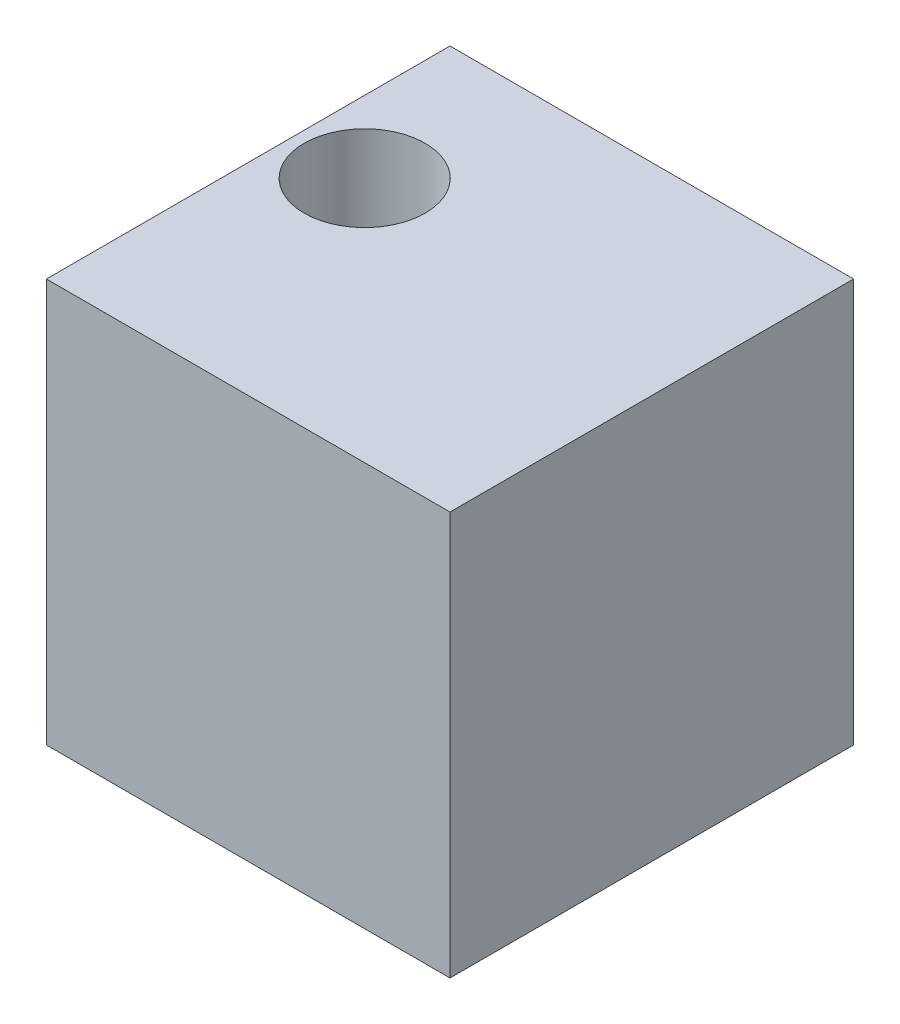
ISO-10303-21;
HEADER;
FILE_DESCRIPTION(('STEP AP214'),'2;1');
FILE_NAME('part.step','',(''),(''),'','','');
FILE_SCHEMA(('AUTOMOTIVE_DESIGN { 1 0 10303 214 1 1 1 1 }'));
ENDSEC;
DATA;
#1=APPLICATION_CONTEXT('core data for automotive mechanical design processes');
#2=APPLICATION_PROTOCOL_DEFINITION('international standard','automotive_design',2000,#1);
#3=PRODUCT_CONTEXT('',#1,'mechanical');
#4=PRODUCT('Part','Part','',(#3));
#5=PRODUCT_RELATED_PRODUCT_CATEGORY('part','',(#4));
#6=PRODUCT_DEFINITION_FORMATION('','',#4);
#7=PRODUCT_DEFINITION_CONTEXT('part definition',#1,'design');
#8=PRODUCT_DEFINITION('design','',#6,#7);
#9=PRODUCT_DEFINITION_SHAPE('','',#8);
#10=(LENGTH_UNIT() NAMED_UNIT(*) SI_UNIT(.MILLI.,.METRE.));
#11=(NAMED_UNIT(*) PLANE_ANGLE_UNIT() SI_UNIT($,.RADIAN.));
#12=(NAMED_UNIT(*) SI_UNIT($,.STERADIAN.) SOLID_ANGLE_UNIT());
#13=UNCERTAINTY_MEASURE_WITH_UNIT(LENGTH_MEASURE(1.E-05),#10,'distance_accuracy_value','');
#14=(GEOMETRIC_REPRESENTATION_CONTEXT(3) GLOBAL_UNCERTAINTY_ASSIGNED_CONTEXT((#13)) GLOBAL_UNIT_ASSIGNED_CONTEXT((#10,
#11,#12)) REPRESENTATION_CONTEXT('',''));
#15=CARTESIAN_POINT('',(0.,0.,0.));
#16=DIRECTION('',(0.,0.,1.));
#17=DIRECTION('',(1.,0.,0.));
#18=AXIS2_PLACEMENT_3D('',#15,#16,#17);
#19=CARTESIAN_POINT('',(0.,0.,25.4));
#20=DIRECTION('',(1.,0.,0.));
#21=DIRECTION('',(0.,0.,-1.));
#22=AXIS2_PLACEMENT_3D('',#19,#20,#21);
#23=PLANE('',#22);
#24=DIRECTION('',(0.,-1.,0.));
#25=VECTOR('',#24,1.);
#26=CARTESIAN_POINT('',(0.,0.,0.));
#27=LINE('',#26,#25);
#28=CARTESIAN_POINT('',(0.,25.4,0.));
#29=VERTEX_POINT('',#28);
#30=CARTESIAN_POINT('',(0.,0.,0.));
#31=VERTEX_POINT('',#30);
#32=EDGE_CURVE('E107',#29,#31,#27,.T.);
#33=ORIENTED_EDGE('',*,*,#32,.T.);
#34=DIRECTION('',(0.,0.,-1.));
#35=VECTOR('',#34,1.);
#36=CARTESIAN_POINT('',(0.,0.,25.4));
#37=LINE('',#36,#35);
#38=CARTESIAN_POINT('',(0.,0.,25.4));
#39=VERTEX_POINT('',#38);
#40=EDGE_CURVE('E11',#39,#31,#37,.T.);
#41=ORIENTED_EDGE('',*,*,#40,.F.);
#42=DIRECTION('',(0.,-1.,0.));
#43=VECTOR('',#42,1.);
#44=CARTESIAN_POINT('',(0.,0.,25.4));
#45=LINE('',#44,#43);
#46=CARTESIAN_POINT('',(0.,25.4,25.4));
#47=VERTEX_POINT('',#46);
#48=EDGE_CURVE('E91',#47,#39,#45,.T.);
#49=ORIENTED_EDGE('',*,*,#48,.F.);
#50=DIRECTION('',(0.,0.,-1.));
#51=VECTOR('',#50,1.);
#52=CARTESIAN_POINT('',(0.,25.4,25.4));
#53=LINE('',#52,#51);
#54=EDGE_CURVE('E103',#47,#29,#53,.T.);
#55=ORIENTED_EDGE('',*,*,#54,.T.);
#56=EDGE_LOOP('',(#33,#41,#49,#55));
#57=FACE_BOUND('',#56,.T.);
#58=ADVANCED_FACE('F39',(#57),#23,.F.);
#59=CARTESIAN_POINT('',(0.,0.,25.4));
#60=DIRECTION('',(0.,1.,0.));
#61=DIRECTION('',(0.,0.,1.));
#62=AXIS2_PLACEMENT_3D('',#59,#60,#61);
#63=PLANE('',#62);
#64=CARTESIAN_POINT('',(4.52047726833796,0.,9.89111738509195));
#65=DIRECTION('',(0.,1.,0.));
#66=DIRECTION('',(0.,0.,1.));
#67=AXIS2_PLACEMENT_3D('',#64,#65,#66);
#68=CIRCLE('',#67,3.81);
#69=CARTESIAN_POINT('',(4.52047726833796,0.,13.7011173850919));
#70=VERTEX_POINT('',#69);
#71=EDGE_CURVE('E111',#70,#70,#68,.T.);
#72=ORIENTED_EDGE('',*,*,#71,.T.);
#73=EDGE_LOOP('',(#72));
#74=FACE_BOUND('',#73,.T.);
#75=DIRECTION('',(1.,0.,0.));
#76=VECTOR('',#75,1.);
#77=CARTESIAN_POINT('',(0.,0.,0.));
#78=LINE('',#77,#76);
#79=CARTESIAN_POINT('',(25.4,0.,0.));
#80=VERTEX_POINT('',#79);
#81=EDGE_CURVE('E96',#31,#80,#78,.T.);
#82=ORIENTED_EDGE('',*,*,#81,.T.);
#83=DIRECTION('',(0.,0.,-1.));
#84=VECTOR('',#83,1.);
#85=CARTESIAN_POINT('',(25.4,0.,25.4));
#86=LINE('',#85,#84);
#87=CARTESIAN_POINT('',(25.4,0.,25.4));
#88=VERTEX_POINT('',#87);
#89=EDGE_CURVE('E48',#88,#80,#86,.T.);
#90=ORIENTED_EDGE('',*,*,#89,.F.);
#91=DIRECTION('',(1.,0.,0.));
#92=VECTOR('',#91,1.);
#93=CARTESIAN_POINT('',(0.,0.,25.4));
#94=LINE('',#93,#92);
#95=EDGE_CURVE('E86',#39,#88,#94,.T.);
#96=ORIENTED_EDGE('',*,*,#95,.F.);
#97=ORIENTED_EDGE('',*,*,#40,.T.);
#98=EDGE_LOOP('',(#82,#90,#96,#97));
#99=FACE_BOUND('',#98,.T.);
#100=ADVANCED_FACE('F95',(#74,#99),#63,.F.);
#101=CARTESIAN_POINT('',(25.4,0.,25.4));
#102=DIRECTION('',(-1.,0.,0.));
#103=DIRECTION('',(0.,0.,1.));
#104=AXIS2_PLACEMENT_3D('',#101,#102,#103);
#105=PLANE('',#104);
#106=DIRECTION('',(0.,1.,0.));
#107=VECTOR('',#106,1.);
#108=CARTESIAN_POINT('',(25.4,0.,0.));
#109=LINE('',#108,#107);
#110=CARTESIAN_POINT('',(25.4,25.4,0.));
#111=VERTEX_POINT('',#110);
#112=EDGE_CURVE('E73',#80,#111,#109,.T.);
#113=ORIENTED_EDGE('',*,*,#112,.T.);
#114=DIRECTION('',(0.,0.,-1.));
#115=VECTOR('',#114,1.);
#116=CARTESIAN_POINT('',(25.4,25.4,25.4));
#117=LINE('',#116,#115);
#118=CARTESIAN_POINT('',(25.4,25.4,25.4));
#119=VERTEX_POINT('',#118);
#120=EDGE_CURVE('E98',#119,#111,#117,.T.);
#121=ORIENTED_EDGE('',*,*,#120,.F.);
#122=DIRECTION('',(0.,1.,0.));
#123=VECTOR('',#122,1.);
#124=CARTESIAN_POINT('',(25.4,0.,25.4));
#125=LINE('',#124,#123);
#126=EDGE_CURVE('E89',#88,#119,#125,.T.);
#127=ORIENTED_EDGE('',*,*,#126,.F.);
#128=ORIENTED_EDGE('',*,*,#89,.T.);
#129=EDGE_LOOP('',(#113,#121,#127,#128));
#130=FACE_BOUND('',#129,.T.);
#131=ADVANCED_FACE('F99',(#130),#105,.F.);
#132=CARTESIAN_POINT('',(0.,25.4,25.4));
#133=DIRECTION('',(0.,-1.,0.));
#134=DIRECTION('',(0.,0.,-1.));
#135=AXIS2_PLACEMENT_3D('',#132,#133,#134);
#136=PLANE('',#135);
#137=CARTESIAN_POINT('',(4.52047726833796,25.4,9.89111738509195));
#138=DIRECTION('',(0.,1.,0.));
#139=DIRECTION('',(0.,0.,1.));
#140=AXIS2_PLACEMENT_3D('',#137,#138,#139);
#141=CIRCLE('',#140,3.81);
#142=CARTESIAN_POINT('',(4.52047726833796,25.4,13.7011173850919));
#143=VERTEX_POINT('',#142);
#144=EDGE_CURVE('E128',#143,#143,#141,.T.);
#145=ORIENTED_EDGE('',*,*,#144,.F.);
#146=EDGE_LOOP('',(#145));
#147=FACE_BOUND('',#146,.T.);
#148=DIRECTION('',(-1.,0.,0.));
#149=VECTOR('',#148,1.);
#150=CARTESIAN_POINT('',(0.,25.4,0.));
#151=LINE('',#150,#149);
#152=EDGE_CURVE('E79',#111,#29,#151,.T.);
#153=ORIENTED_EDGE('',*,*,#152,.T.);
#154=ORIENTED_EDGE('',*,*,#54,.F.);
#155=DIRECTION('',(-1.,0.,0.));
#156=VECTOR('',#155,1.);
#157=CARTESIAN_POINT('',(0.,25.4,25.4));
#158=LINE('',#157,#156);
#159=EDGE_CURVE('E56',#119,#47,#158,.T.);
#160=ORIENTED_EDGE('',*,*,#159,.F.);
#161=ORIENTED_EDGE('',*,*,#120,.T.);
#162=EDGE_LOOP('',(#153,#154,#160,#161));
#163=FACE_BOUND('',#162,.T.);
#164=ADVANCED_FACE('F121',(#147,#163),#136,.F.);
#165=CARTESIAN_POINT('',(0.,0.,25.4));
#166=DIRECTION('',(0.,0.,-1.));
#167=DIRECTION('',(-1.,0.,0.));
#168=AXIS2_PLACEMENT_3D('',#165,#166,#167);
#169=PLANE('',#168);
#170=ORIENTED_EDGE('',*,*,#48,.T.);
#171=ORIENTED_EDGE('',*,*,#95,.T.);
#172=ORIENTED_EDGE('',*,*,#126,.T.);
#173=ORIENTED_EDGE('',*,*,#159,.T.);
#174=EDGE_LOOP('',(#170,#171,#172,#173));
#175=FACE_BOUND('',#174,.T.);
#176=ADVANCED_FACE('F87',(#175),#169,.F.);
#177=CARTESIAN_POINT('',(0.,0.,0.));
#178=DIRECTION('',(0.,0.,-1.));
#179=DIRECTION('',(-1.,0.,0.));
#180=AXIS2_PLACEMENT_3D('',#177,#178,#179);
#181=PLANE('',#180);
#182=ORIENTED_EDGE('',*,*,#32,.F.);
#183=ORIENTED_EDGE('',*,*,#152,.F.);
#184=ORIENTED_EDGE('',*,*,#112,.F.);
#185=ORIENTED_EDGE('',*,*,#81,.F.);
#186=EDGE_LOOP('',(#182,#183,#184,#185));
#187=FACE_BOUND('',#186,.T.);
#188=ADVANCED_FACE('F124',(#187),#181,.T.);
#189=CARTESIAN_POINT('',(4.52047726833796,0.,9.89111738509195));
#190=DIRECTION('',(0.,1.,0.));
#191=DIRECTION('',(0.,0.,1.));
#192=AXIS2_PLACEMENT_3D('',#189,#190,#191);
#193=CYLINDRICAL_SURFACE('',#192,3.81);
#194=ORIENTED_EDGE('',*,*,#71,.F.);
#195=EDGE_LOOP('',(#194));
#196=FACE_BOUND('',#195,.T.);
#197=ORIENTED_EDGE('',*,*,#144,.T.);
#198=EDGE_LOOP('',(#197));
#199=FACE_BOUND('',#198,.T.);
#200=ADVANCED_FACE('F137',(#196,#199),#193,.F.);
#201=CLOSED_SHELL('',(#58,#100,#131,#164,#176,#188,#200));
#202=MANIFOLD_SOLID_BREP('B2',#201);
#203=ADVANCED_BREP_SHAPE_REPRESENTATION('',(#18,#202),#14);
#204=SHAPE_DEFINITION_REPRESENTATION(#9,#203);
ENDSEC;
END-ISO-10303-21;
